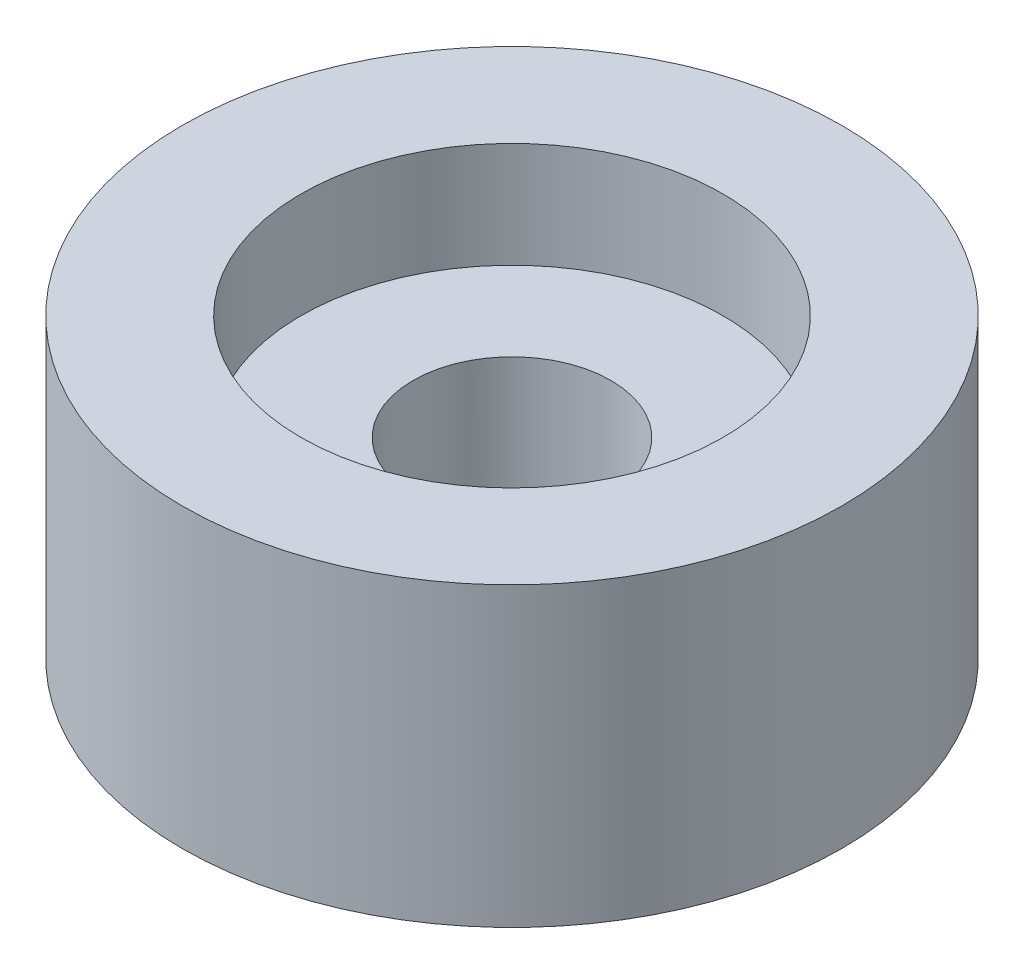
ISO-10303-21;
HEADER;
FILE_DESCRIPTION(('STEP AP214'),'2;1');
FILE_NAME('part.step','',(''),(''),'','','');
FILE_SCHEMA(('AUTOMOTIVE_DESIGN { 1 0 10303 214 1 1 1 1 }'));
ENDSEC;
DATA;
#1=APPLICATION_CONTEXT('core data for automotive mechanical design processes');
#2=APPLICATION_PROTOCOL_DEFINITION('international standard','automotive_design',2000,#1);
#3=PRODUCT_CONTEXT('',#1,'mechanical');
#4=PRODUCT('Part','Part','',(#3));
#5=PRODUCT_RELATED_PRODUCT_CATEGORY('part','',(#4));
#6=PRODUCT_DEFINITION_FORMATION('','',#4);
#7=PRODUCT_DEFINITION_CONTEXT('part definition',#1,'design');
#8=PRODUCT_DEFINITION('design','',#6,#7);
#9=PRODUCT_DEFINITION_SHAPE('','',#8);
#10=(LENGTH_UNIT() NAMED_UNIT(*) SI_UNIT(.MILLI.,.METRE.));
#11=(NAMED_UNIT(*) PLANE_ANGLE_UNIT() SI_UNIT($,.RADIAN.));
#12=(NAMED_UNIT(*) SI_UNIT($,.STERADIAN.) SOLID_ANGLE_UNIT());
#13=UNCERTAINTY_MEASURE_WITH_UNIT(LENGTH_MEASURE(1.E-05),#10,'distance_accuracy_value','');
#14=(GEOMETRIC_REPRESENTATION_CONTEXT(3) GLOBAL_UNCERTAINTY_ASSIGNED_CONTEXT((#13)) GLOBAL_UNIT_ASSIGNED_CONTEXT((#10,
#11,#12)) REPRESENTATION_CONTEXT('',''));
#15=CARTESIAN_POINT('',(0.,0.,0.));
#16=DIRECTION('',(0.,0.,1.));
#17=DIRECTION('',(1.,0.,0.));
#18=AXIS2_PLACEMENT_3D('',#15,#16,#17);
#19=CARTESIAN_POINT('',(0.,0.,0.));
#20=DIRECTION('',(0.,-1.,0.));
#21=DIRECTION('',(0.,0.,-1.));
#22=AXIS2_PLACEMENT_3D('',#19,#20,#21);
#23=CYLINDRICAL_SURFACE('',#22,3.);
#24=CARTESIAN_POINT('',(0.,0.,0.));
#25=DIRECTION('',(0.,-1.,0.));
#26=DIRECTION('',(0.,0.,-1.));
#27=AXIS2_PLACEMENT_3D('',#24,#25,#26);
#28=CIRCLE('',#27,3.);
#29=CARTESIAN_POINT('',(0.,0.,-3.));
#30=VERTEX_POINT('',#29);
#31=EDGE_CURVE('E52',#30,#30,#28,.T.);
#32=ORIENTED_EDGE('',*,*,#31,.T.);
#33=EDGE_LOOP('',(#32));
#34=FACE_BOUND('',#33,.T.);
#35=CARTESIAN_POINT('',(0.,5.8,0.));
#36=DIRECTION('',(0.,1.,0.));
#37=DIRECTION('',(0.,0.,1.));
#38=AXIS2_PLACEMENT_3D('',#35,#36,#37);
#39=CIRCLE('',#38,3.);
#40=CARTESIAN_POINT('',(0.,5.8,3.));
#41=VERTEX_POINT('',#40);
#42=EDGE_CURVE('E47',#41,#41,#39,.T.);
#43=ORIENTED_EDGE('',*,*,#42,.T.);
#44=EDGE_LOOP('',(#43));
#45=FACE_BOUND('',#44,.T.);
#46=ADVANCED_FACE('F43',(#34,#45),#23,.F.);
#47=CARTESIAN_POINT('',(0.,0.,0.));
#48=DIRECTION('',(0.,-1.,0.));
#49=DIRECTION('',(0.,0.,-1.));
#50=AXIS2_PLACEMENT_3D('',#47,#48,#49);
#51=CYLINDRICAL_SURFACE('',#50,10.);
#52=CARTESIAN_POINT('',(0.,9.,0.));
#53=DIRECTION('',(0.,-1.,0.));
#54=DIRECTION('',(0.,0.,-1.));
#55=AXIS2_PLACEMENT_3D('',#52,#53,#54);
#56=CIRCLE('',#55,10.);
#57=CARTESIAN_POINT('',(0.,9.,-10.));
#58=VERTEX_POINT('',#57);
#59=EDGE_CURVE('E10',#58,#58,#56,.T.);
#60=ORIENTED_EDGE('',*,*,#59,.T.);
#61=EDGE_LOOP('',(#60));
#62=FACE_BOUND('',#61,.T.);
#63=CARTESIAN_POINT('',(0.,0.,0.));
#64=DIRECTION('',(0.,-1.,0.));
#65=DIRECTION('',(0.,0.,-1.));
#66=AXIS2_PLACEMENT_3D('',#63,#64,#65);
#67=CIRCLE('',#66,10.);
#68=CARTESIAN_POINT('',(0.,0.,-10.));
#69=VERTEX_POINT('',#68);
#70=EDGE_CURVE('E57',#69,#69,#67,.T.);
#71=ORIENTED_EDGE('',*,*,#70,.F.);
#72=EDGE_LOOP('',(#71));
#73=FACE_BOUND('',#72,.T.);
#74=ADVANCED_FACE('F45',(#62,#73),#51,.T.);
#75=CARTESIAN_POINT('',(10.,9.,0.));
#76=DIRECTION('',(0.,1.,0.));
#77=DIRECTION('',(0.,0.,1.));
#78=AXIS2_PLACEMENT_3D('',#75,#76,#77);
#79=PLANE('',#78);
#80=CARTESIAN_POINT('',(0.,9.,0.));
#81=DIRECTION('',(0.,1.,0.));
#82=DIRECTION('',(0.,0.,1.));
#83=AXIS2_PLACEMENT_3D('',#80,#81,#82);
#84=CIRCLE('',#83,6.4);
#85=CARTESIAN_POINT('',(0.,9.,6.4));
#86=VERTEX_POINT('',#85);
#87=EDGE_CURVE('E63',#86,#86,#84,.T.);
#88=ORIENTED_EDGE('',*,*,#87,.F.);
#89=EDGE_LOOP('',(#88));
#90=FACE_BOUND('',#89,.T.);
#91=ORIENTED_EDGE('',*,*,#59,.F.);
#92=EDGE_LOOP('',(#91));
#93=FACE_BOUND('',#92,.T.);
#94=ADVANCED_FACE('F95',(#90,#93),#79,.T.);
#95=CARTESIAN_POINT('',(3.,0.,0.));
#96=DIRECTION('',(0.,-1.,0.));
#97=DIRECTION('',(0.,0.,-1.));
#98=AXIS2_PLACEMENT_3D('',#95,#96,#97);
#99=PLANE('',#98);
#100=ORIENTED_EDGE('',*,*,#70,.T.);
#101=EDGE_LOOP('',(#100));
#102=FACE_BOUND('',#101,.T.);
#103=ORIENTED_EDGE('',*,*,#31,.F.);
#104=EDGE_LOOP('',(#103));
#105=FACE_BOUND('',#104,.T.);
#106=ADVANCED_FACE('F84',(#102,#105),#99,.T.);
#107=CARTESIAN_POINT('',(0.,5.8,0.));
#108=DIRECTION('',(0.,1.,0.));
#109=DIRECTION('',(0.,0.,1.));
#110=AXIS2_PLACEMENT_3D('',#107,#108,#109);
#111=CYLINDRICAL_SURFACE('',#110,6.4);
#112=CARTESIAN_POINT('',(0.,5.8,0.));
#113=DIRECTION('',(0.,1.,0.));
#114=DIRECTION('',(0.,0.,1.));
#115=AXIS2_PLACEMENT_3D('',#112,#113,#114);
#116=CIRCLE('',#115,6.4);
#117=CARTESIAN_POINT('',(0.,5.8,6.4));
#118=VERTEX_POINT('',#117);
#119=EDGE_CURVE('E67',#118,#118,#116,.T.);
#120=ORIENTED_EDGE('',*,*,#119,.F.);
#121=EDGE_LOOP('',(#120));
#122=FACE_BOUND('',#121,.T.);
#123=ORIENTED_EDGE('',*,*,#87,.T.);
#124=EDGE_LOOP('',(#123));
#125=FACE_BOUND('',#124,.T.);
#126=ADVANCED_FACE('F79',(#122,#125),#111,.F.);
#127=CARTESIAN_POINT('',(0.,5.8,0.));
#128=DIRECTION('',(0.,1.,0.));
#129=DIRECTION('',(0.,0.,1.));
#130=AXIS2_PLACEMENT_3D('',#127,#128,#129);
#131=PLANE('',#130);
#132=ORIENTED_EDGE('',*,*,#42,.F.);
#133=EDGE_LOOP('',(#132));
#134=FACE_BOUND('',#133,.T.);
#135=ORIENTED_EDGE('',*,*,#119,.T.);
#136=EDGE_LOOP('',(#135));
#137=FACE_BOUND('',#136,.T.);
#138=ADVANCED_FACE('F77',(#134,#137),#131,.T.);
#139=CLOSED_SHELL('',(#46,#74,#94,#106,#126,#138));
#140=MANIFOLD_SOLID_BREP('B2',#139);
#141=ADVANCED_BREP_SHAPE_REPRESENTATION('',(#18,#140),#14);
#142=SHAPE_DEFINITION_REPRESENTATION(#9,#141);
ENDSEC;
END-ISO-10303-21;
